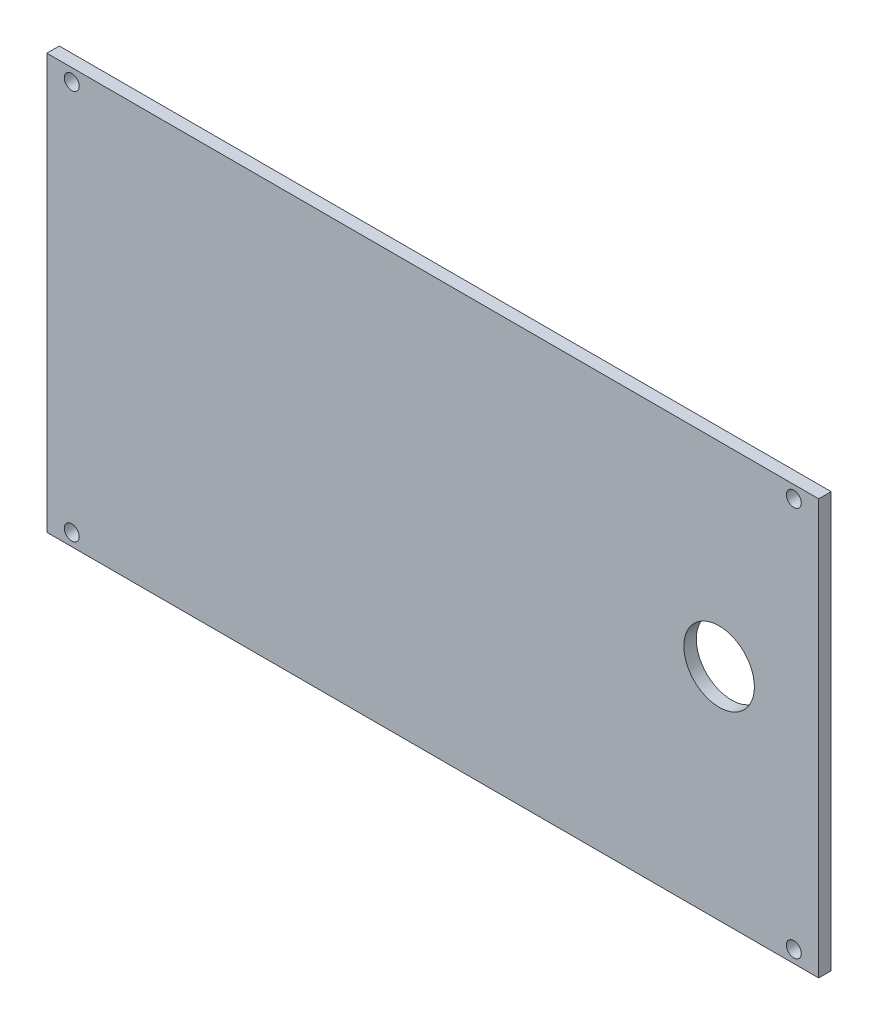
ISO-10303-21;
HEADER;
FILE_DESCRIPTION(('STEP AP214'),'2;1');
FILE_NAME('part.step','',(''),(''),'','','');
FILE_SCHEMA(('AUTOMOTIVE_DESIGN { 1 0 10303 214 1 1 1 1 }'));
ENDSEC;
DATA;
#1=APPLICATION_CONTEXT('core data for automotive mechanical design processes');
#2=APPLICATION_PROTOCOL_DEFINITION('international standard','automotive_design',2000,#1);
#3=PRODUCT_CONTEXT('',#1,'mechanical');
#4=PRODUCT('Part','Part','',(#3));
#5=PRODUCT_RELATED_PRODUCT_CATEGORY('part','',(#4));
#6=PRODUCT_DEFINITION_FORMATION('','',#4);
#7=PRODUCT_DEFINITION_CONTEXT('part definition',#1,'design');
#8=PRODUCT_DEFINITION('design','',#6,#7);
#9=PRODUCT_DEFINITION_SHAPE('','',#8);
#10=(LENGTH_UNIT() NAMED_UNIT(*) SI_UNIT(.MILLI.,.METRE.));
#11=(NAMED_UNIT(*) PLANE_ANGLE_UNIT() SI_UNIT($,.RADIAN.));
#12=(NAMED_UNIT(*) SI_UNIT($,.STERADIAN.) SOLID_ANGLE_UNIT());
#13=UNCERTAINTY_MEASURE_WITH_UNIT(LENGTH_MEASURE(1.E-05),#10,'distance_accuracy_value','');
#14=(GEOMETRIC_REPRESENTATION_CONTEXT(3) GLOBAL_UNCERTAINTY_ASSIGNED_CONTEXT((#13)) GLOBAL_UNIT_ASSIGNED_CONTEXT((#10,
#11,#12)) REPRESENTATION_CONTEXT('',''));
#15=CARTESIAN_POINT('',(0.,0.,0.));
#16=DIRECTION('',(0.,0.,1.));
#17=DIRECTION('',(1.,0.,0.));
#18=AXIS2_PLACEMENT_3D('',#15,#16,#17);
#19=CARTESIAN_POINT('',(0.,0.,3.));
#20=DIRECTION('',(1.,0.,0.));
#21=DIRECTION('',(0.,0.,-1.));
#22=AXIS2_PLACEMENT_3D('',#19,#20,#21);
#23=PLANE('',#22);
#24=DIRECTION('',(0.,-1.,0.));
#25=VECTOR('',#24,1.);
#26=CARTESIAN_POINT('',(0.,0.,0.));
#27=LINE('',#26,#25);
#28=CARTESIAN_POINT('',(0.,100.,0.));
#29=VERTEX_POINT('',#28);
#30=CARTESIAN_POINT('',(0.,0.,0.));
#31=VERTEX_POINT('',#30);
#32=EDGE_CURVE('E97',#29,#31,#27,.T.);
#33=ORIENTED_EDGE('',*,*,#32,.T.);
#34=DIRECTION('',(0.,0.,-1.));
#35=VECTOR('',#34,1.);
#36=CARTESIAN_POINT('',(0.,0.,3.));
#37=LINE('',#36,#35);
#38=CARTESIAN_POINT('',(0.,0.,3.));
#39=VERTEX_POINT('',#38);
#40=EDGE_CURVE('E11',#39,#31,#37,.T.);
#41=ORIENTED_EDGE('',*,*,#40,.F.);
#42=DIRECTION('',(0.,-1.,0.));
#43=VECTOR('',#42,1.);
#44=CARTESIAN_POINT('',(0.,0.,3.));
#45=LINE('',#44,#43);
#46=CARTESIAN_POINT('',(0.,100.,3.));
#47=VERTEX_POINT('',#46);
#48=EDGE_CURVE('E85',#47,#39,#45,.T.);
#49=ORIENTED_EDGE('',*,*,#48,.F.);
#50=DIRECTION('',(0.,0.,-1.));
#51=VECTOR('',#50,1.);
#52=CARTESIAN_POINT('',(0.,100.,3.));
#53=LINE('',#52,#51);
#54=EDGE_CURVE('E93',#47,#29,#53,.T.);
#55=ORIENTED_EDGE('',*,*,#54,.T.);
#56=EDGE_LOOP('',(#33,#41,#49,#55));
#57=FACE_BOUND('',#56,.T.);
#58=ADVANCED_FACE('F34',(#57),#23,.F.);
#59=CARTESIAN_POINT('',(0.,0.,3.));
#60=DIRECTION('',(0.,1.,0.));
#61=DIRECTION('',(0.,0.,1.));
#62=AXIS2_PLACEMENT_3D('',#59,#60,#61);
#63=PLANE('',#62);
#64=DIRECTION('',(1.,0.,0.));
#65=VECTOR('',#64,1.);
#66=CARTESIAN_POINT('',(0.,0.,0.));
#67=LINE('',#66,#65);
#68=CARTESIAN_POINT('',(186.,0.,0.));
#69=VERTEX_POINT('',#68);
#70=EDGE_CURVE('E89',#31,#69,#67,.T.);
#71=ORIENTED_EDGE('',*,*,#70,.T.);
#72=DIRECTION('',(0.,0.,-1.));
#73=VECTOR('',#72,1.);
#74=CARTESIAN_POINT('',(186.,0.,3.));
#75=LINE('',#74,#73);
#76=CARTESIAN_POINT('',(186.,0.,3.));
#77=VERTEX_POINT('',#76);
#78=EDGE_CURVE('E42',#77,#69,#75,.T.);
#79=ORIENTED_EDGE('',*,*,#78,.F.);
#80=DIRECTION('',(1.,0.,0.));
#81=VECTOR('',#80,1.);
#82=CARTESIAN_POINT('',(0.,0.,3.));
#83=LINE('',#82,#81);
#84=EDGE_CURVE('E80',#39,#77,#83,.T.);
#85=ORIENTED_EDGE('',*,*,#84,.F.);
#86=ORIENTED_EDGE('',*,*,#40,.T.);
#87=EDGE_LOOP('',(#71,#79,#85,#86));
#88=FACE_BOUND('',#87,.T.);
#89=ADVANCED_FACE('F88',(#88),#63,.F.);
#90=CARTESIAN_POINT('',(186.,0.,3.));
#91=DIRECTION('',(-1.,0.,0.));
#92=DIRECTION('',(0.,0.,1.));
#93=AXIS2_PLACEMENT_3D('',#90,#91,#92);
#94=PLANE('',#93);
#95=DIRECTION('',(0.,1.,0.));
#96=VECTOR('',#95,1.);
#97=CARTESIAN_POINT('',(186.,0.,0.));
#98=LINE('',#97,#96);
#99=CARTESIAN_POINT('',(186.,100.,0.));
#100=VERTEX_POINT('',#99);
#101=EDGE_CURVE('E67',#69,#100,#98,.T.);
#102=ORIENTED_EDGE('',*,*,#101,.T.);
#103=DIRECTION('',(0.,0.,-1.));
#104=VECTOR('',#103,1.);
#105=CARTESIAN_POINT('',(186.,100.,3.));
#106=LINE('',#105,#104);
#107=CARTESIAN_POINT('',(186.,100.,3.));
#108=VERTEX_POINT('',#107);
#109=EDGE_CURVE('E90',#108,#100,#106,.T.);
#110=ORIENTED_EDGE('',*,*,#109,.F.);
#111=DIRECTION('',(0.,1.,0.));
#112=VECTOR('',#111,1.);
#113=CARTESIAN_POINT('',(186.,0.,3.));
#114=LINE('',#113,#112);
#115=EDGE_CURVE('E83',#77,#108,#114,.T.);
#116=ORIENTED_EDGE('',*,*,#115,.F.);
#117=ORIENTED_EDGE('',*,*,#78,.T.);
#118=EDGE_LOOP('',(#102,#110,#116,#117));
#119=FACE_BOUND('',#118,.T.);
#120=ADVANCED_FACE('F91',(#119),#94,.F.);
#121=CARTESIAN_POINT('',(0.,100.,3.));
#122=DIRECTION('',(0.,-1.,0.));
#123=DIRECTION('',(0.,0.,-1.));
#124=AXIS2_PLACEMENT_3D('',#121,#122,#123);
#125=PLANE('',#124);
#126=DIRECTION('',(-1.,0.,0.));
#127=VECTOR('',#126,1.);
#128=CARTESIAN_POINT('',(0.,100.,0.));
#129=LINE('',#128,#127);
#130=EDGE_CURVE('E73',#100,#29,#129,.T.);
#131=ORIENTED_EDGE('',*,*,#130,.T.);
#132=ORIENTED_EDGE('',*,*,#54,.F.);
#133=DIRECTION('',(-1.,0.,0.));
#134=VECTOR('',#133,1.);
#135=CARTESIAN_POINT('',(0.,100.,3.));
#136=LINE('',#135,#134);
#137=EDGE_CURVE('E50',#108,#47,#136,.T.);
#138=ORIENTED_EDGE('',*,*,#137,.F.);
#139=ORIENTED_EDGE('',*,*,#109,.T.);
#140=EDGE_LOOP('',(#131,#132,#138,#139));
#141=FACE_BOUND('',#140,.T.);
#142=ADVANCED_FACE('F105',(#141),#125,.F.);
#143=CARTESIAN_POINT('',(0.,0.,3.));
#144=DIRECTION('',(0.,0.,-1.));
#145=DIRECTION('',(-1.,0.,0.));
#146=AXIS2_PLACEMENT_3D('',#143,#144,#145);
#147=PLANE('',#146);
#148=CARTESIAN_POINT('',(6.,97.,3.));
#149=DIRECTION('',(0.,0.,1.));
#150=DIRECTION('',(1.,0.,0.));
#151=AXIS2_PLACEMENT_3D('',#148,#149,#150);
#152=CIRCLE('',#151,1.8);
#153=CARTESIAN_POINT('',(7.8,97.,3.));
#154=VERTEX_POINT('',#153);
#155=EDGE_CURVE('E120',#154,#154,#152,.T.);
#156=ORIENTED_EDGE('',*,*,#155,.F.);
#157=EDGE_LOOP('',(#156));
#158=FACE_BOUND('',#157,.T.);
#159=CARTESIAN_POINT('',(6.,2.99999999999998,3.));
#160=DIRECTION('',(0.,0.,1.));
#161=DIRECTION('',(1.,0.,0.));
#162=AXIS2_PLACEMENT_3D('',#159,#160,#161);
#163=CIRCLE('',#162,1.8);
#164=CARTESIAN_POINT('',(7.8,2.99999999999998,3.));
#165=VERTEX_POINT('',#164);
#166=EDGE_CURVE('E126',#165,#165,#163,.T.);
#167=ORIENTED_EDGE('',*,*,#166,.F.);
#168=EDGE_LOOP('',(#167));
#169=FACE_BOUND('',#168,.T.);
#170=CARTESIAN_POINT('',(180.,97.,3.));
#171=DIRECTION('',(0.,0.,1.));
#172=DIRECTION('',(1.,0.,0.));
#173=AXIS2_PLACEMENT_3D('',#170,#171,#172);
#174=CIRCLE('',#173,1.80000000000001);
#175=CARTESIAN_POINT('',(181.8,97.,3.));
#176=VERTEX_POINT('',#175);
#177=EDGE_CURVE('E132',#176,#176,#174,.T.);
#178=ORIENTED_EDGE('',*,*,#177,.F.);
#179=EDGE_LOOP('',(#178));
#180=FACE_BOUND('',#179,.T.);
#181=CARTESIAN_POINT('',(180.,3.,3.));
#182=DIRECTION('',(0.,0.,1.));
#183=DIRECTION('',(1.,0.,0.));
#184=AXIS2_PLACEMENT_3D('',#181,#182,#183);
#185=CIRCLE('',#184,1.80000000000001);
#186=CARTESIAN_POINT('',(181.8,3.,3.));
#187=VERTEX_POINT('',#186);
#188=EDGE_CURVE('E114',#187,#187,#185,.T.);
#189=ORIENTED_EDGE('',*,*,#188,.F.);
#190=EDGE_LOOP('',(#189));
#191=FACE_BOUND('',#190,.T.);
#192=CARTESIAN_POINT('',(162.,53.,3.));
#193=DIRECTION('',(0.,0.,1.));
#194=DIRECTION('',(1.,0.,0.));
#195=AXIS2_PLACEMENT_3D('',#192,#193,#194);
#196=CIRCLE('',#195,8.50000000000001);
#197=CARTESIAN_POINT('',(170.5,53.,3.));
#198=VERTEX_POINT('',#197);
#199=EDGE_CURVE('E111',#198,#198,#196,.T.);
#200=ORIENTED_EDGE('',*,*,#199,.F.);
#201=EDGE_LOOP('',(#200));
#202=FACE_BOUND('',#201,.T.);
#203=ORIENTED_EDGE('',*,*,#48,.T.);
#204=ORIENTED_EDGE('',*,*,#84,.T.);
#205=ORIENTED_EDGE('',*,*,#115,.T.);
#206=ORIENTED_EDGE('',*,*,#137,.T.);
#207=EDGE_LOOP('',(#203,#204,#205,#206));
#208=FACE_BOUND('',#207,.T.);
#209=ADVANCED_FACE('F81',(#158,#169,#180,#191,#202,#208),#147,.F.);
#210=CARTESIAN_POINT('',(0.,0.,0.));
#211=DIRECTION('',(0.,0.,-1.));
#212=DIRECTION('',(-1.,0.,0.));
#213=AXIS2_PLACEMENT_3D('',#210,#211,#212);
#214=PLANE('',#213);
#215=CARTESIAN_POINT('',(6.,97.,0.));
#216=DIRECTION('',(0.,0.,1.));
#217=DIRECTION('',(1.,0.,0.));
#218=AXIS2_PLACEMENT_3D('',#215,#216,#217);
#219=CIRCLE('',#218,1.8);
#220=CARTESIAN_POINT('',(7.8,97.,0.));
#221=VERTEX_POINT('',#220);
#222=EDGE_CURVE('E117',#221,#221,#219,.T.);
#223=ORIENTED_EDGE('',*,*,#222,.T.);
#224=EDGE_LOOP('',(#223));
#225=FACE_BOUND('',#224,.T.);
#226=CARTESIAN_POINT('',(6.,2.99999999999998,0.));
#227=DIRECTION('',(0.,0.,1.));
#228=DIRECTION('',(1.,0.,0.));
#229=AXIS2_PLACEMENT_3D('',#226,#227,#228);
#230=CIRCLE('',#229,1.8);
#231=CARTESIAN_POINT('',(7.8,2.99999999999998,0.));
#232=VERTEX_POINT('',#231);
#233=EDGE_CURVE('E123',#232,#232,#230,.T.);
#234=ORIENTED_EDGE('',*,*,#233,.T.);
#235=EDGE_LOOP('',(#234));
#236=FACE_BOUND('',#235,.T.);
#237=CARTESIAN_POINT('',(180.,97.,0.));
#238=DIRECTION('',(0.,0.,1.));
#239=DIRECTION('',(1.,0.,0.));
#240=AXIS2_PLACEMENT_3D('',#237,#238,#239);
#241=CIRCLE('',#240,1.80000000000001);
#242=CARTESIAN_POINT('',(181.8,97.,0.));
#243=VERTEX_POINT('',#242);
#244=EDGE_CURVE('E129',#243,#243,#241,.T.);
#245=ORIENTED_EDGE('',*,*,#244,.T.);
#246=EDGE_LOOP('',(#245));
#247=FACE_BOUND('',#246,.T.);
#248=CARTESIAN_POINT('',(180.,3.,0.));
#249=DIRECTION('',(0.,0.,1.));
#250=DIRECTION('',(1.,0.,0.));
#251=AXIS2_PLACEMENT_3D('',#248,#249,#250);
#252=CIRCLE('',#251,1.80000000000001);
#253=CARTESIAN_POINT('',(181.8,3.,0.));
#254=VERTEX_POINT('',#253);
#255=EDGE_CURVE('E135',#254,#254,#252,.T.);
#256=ORIENTED_EDGE('',*,*,#255,.T.);
#257=EDGE_LOOP('',(#256));
#258=FACE_BOUND('',#257,.T.);
#259=CARTESIAN_POINT('',(162.,53.,0.));
#260=DIRECTION('',(0.,0.,1.));
#261=DIRECTION('',(1.,0.,0.));
#262=AXIS2_PLACEMENT_3D('',#259,#260,#261);
#263=CIRCLE('',#262,8.50000000000001);
#264=CARTESIAN_POINT('',(170.5,53.,0.));
#265=VERTEX_POINT('',#264);
#266=EDGE_CURVE('E100',#265,#265,#263,.T.);
#267=ORIENTED_EDGE('',*,*,#266,.T.);
#268=EDGE_LOOP('',(#267));
#269=FACE_BOUND('',#268,.T.);
#270=ORIENTED_EDGE('',*,*,#32,.F.);
#271=ORIENTED_EDGE('',*,*,#130,.F.);
#272=ORIENTED_EDGE('',*,*,#101,.F.);
#273=ORIENTED_EDGE('',*,*,#70,.F.);
#274=EDGE_LOOP('',(#270,#271,#272,#273));
#275=FACE_BOUND('',#274,.T.);
#276=ADVANCED_FACE('F108',(#225,#236,#247,#258,#269,#275),#214,.T.);
#277=CARTESIAN_POINT('',(162.,53.,0.));
#278=DIRECTION('',(0.,0.,1.));
#279=DIRECTION('',(1.,0.,0.));
#280=AXIS2_PLACEMENT_3D('',#277,#278,#279);
#281=CYLINDRICAL_SURFACE('',#280,8.50000000000001);
#282=ORIENTED_EDGE('',*,*,#266,.F.);
#283=EDGE_LOOP('',(#282));
#284=FACE_BOUND('',#283,.T.);
#285=ORIENTED_EDGE('',*,*,#199,.T.);
#286=EDGE_LOOP('',(#285));
#287=FACE_BOUND('',#286,.T.);
#288=ADVANCED_FACE('F149',(#284,#287),#281,.F.);
#289=CARTESIAN_POINT('',(180.,3.,0.));
#290=DIRECTION('',(0.,0.,1.));
#291=DIRECTION('',(1.,0.,0.));
#292=AXIS2_PLACEMENT_3D('',#289,#290,#291);
#293=CYLINDRICAL_SURFACE('',#292,1.80000000000001);
#294=ORIENTED_EDGE('',*,*,#255,.F.);
#295=EDGE_LOOP('',(#294));
#296=FACE_BOUND('',#295,.T.);
#297=ORIENTED_EDGE('',*,*,#188,.T.);
#298=EDGE_LOOP('',(#297));
#299=FACE_BOUND('',#298,.T.);
#300=ADVANCED_FACE('F141',(#296,#299),#293,.F.);
#301=CARTESIAN_POINT('',(180.,97.,0.));
#302=DIRECTION('',(0.,0.,1.));
#303=DIRECTION('',(1.,0.,0.));
#304=AXIS2_PLACEMENT_3D('',#301,#302,#303);
#305=CYLINDRICAL_SURFACE('',#304,1.80000000000001);
#306=ORIENTED_EDGE('',*,*,#244,.F.);
#307=EDGE_LOOP('',(#306));
#308=FACE_BOUND('',#307,.T.);
#309=ORIENTED_EDGE('',*,*,#177,.T.);
#310=EDGE_LOOP('',(#309));
#311=FACE_BOUND('',#310,.T.);
#312=ADVANCED_FACE('F157',(#308,#311),#305,.F.);
#313=CARTESIAN_POINT('',(6.,2.99999999999998,0.));
#314=DIRECTION('',(0.,0.,1.));
#315=DIRECTION('',(1.,0.,0.));
#316=AXIS2_PLACEMENT_3D('',#313,#314,#315);
#317=CYLINDRICAL_SURFACE('',#316,1.8);
#318=ORIENTED_EDGE('',*,*,#233,.F.);
#319=EDGE_LOOP('',(#318));
#320=FACE_BOUND('',#319,.T.);
#321=ORIENTED_EDGE('',*,*,#166,.T.);
#322=EDGE_LOOP('',(#321));
#323=FACE_BOUND('',#322,.T.);
#324=ADVANCED_FACE('F205',(#320,#323),#317,.F.);
#325=CARTESIAN_POINT('',(6.,97.,0.));
#326=DIRECTION('',(0.,0.,1.));
#327=DIRECTION('',(1.,0.,0.));
#328=AXIS2_PLACEMENT_3D('',#325,#326,#327);
#329=CYLINDRICAL_SURFACE('',#328,1.8);
#330=ORIENTED_EDGE('',*,*,#222,.F.);
#331=EDGE_LOOP('',(#330));
#332=FACE_BOUND('',#331,.T.);
#333=ORIENTED_EDGE('',*,*,#155,.T.);
#334=EDGE_LOOP('',(#333));
#335=FACE_BOUND('',#334,.T.);
#336=ADVANCED_FACE('F215',(#332,#335),#329,.F.);
#337=CLOSED_SHELL('',(#58,#89,#120,#142,#209,#276,#288,#300,#312,#324,#336));
#338=MANIFOLD_SOLID_BREP('B2',#337);
#339=ADVANCED_BREP_SHAPE_REPRESENTATION('',(#18,#338),#14);
#340=SHAPE_DEFINITION_REPRESENTATION(#9,#339);
ENDSEC;
END-ISO-10303-21;
